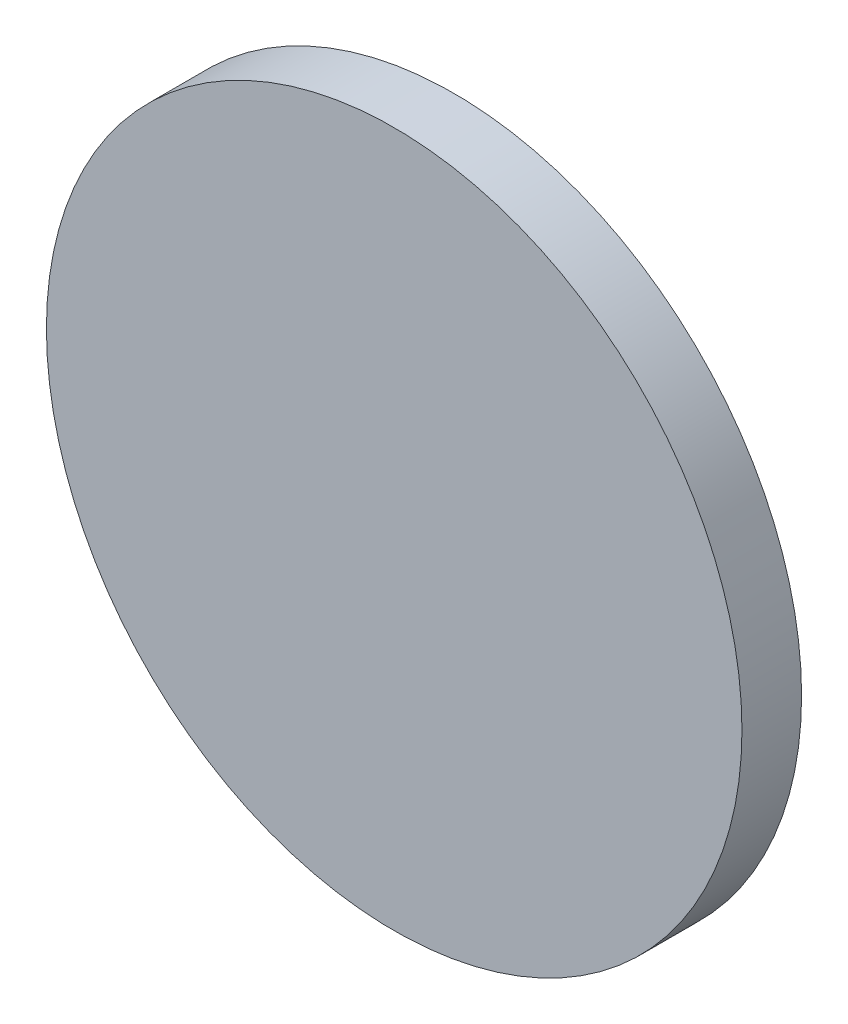
ISO-10303-21;
HEADER;
FILE_DESCRIPTION(('STEP AP214'),'2;1');
FILE_NAME('part.step','',(''),(''),'','','');
FILE_SCHEMA(('AUTOMOTIVE_DESIGN { 1 0 10303 214 1 1 1 1 }'));
ENDSEC;
DATA;
#1=APPLICATION_CONTEXT('core data for automotive mechanical design processes');
#2=APPLICATION_PROTOCOL_DEFINITION('international standard','automotive_design',2000,#1);
#3=PRODUCT_CONTEXT('',#1,'mechanical');
#4=PRODUCT('Part','Part','',(#3));
#5=PRODUCT_RELATED_PRODUCT_CATEGORY('part','',(#4));
#6=PRODUCT_DEFINITION_FORMATION('','',#4);
#7=PRODUCT_DEFINITION_CONTEXT('part definition',#1,'design');
#8=PRODUCT_DEFINITION('design','',#6,#7);
#9=PRODUCT_DEFINITION_SHAPE('','',#8);
#10=(LENGTH_UNIT() NAMED_UNIT(*) SI_UNIT(.MILLI.,.METRE.));
#11=(NAMED_UNIT(*) PLANE_ANGLE_UNIT() SI_UNIT($,.RADIAN.));
#12=(NAMED_UNIT(*) SI_UNIT($,.STERADIAN.) SOLID_ANGLE_UNIT());
#13=UNCERTAINTY_MEASURE_WITH_UNIT(LENGTH_MEASURE(1.E-05),#10,'distance_accuracy_value','');
#14=(GEOMETRIC_REPRESENTATION_CONTEXT(3) GLOBAL_UNCERTAINTY_ASSIGNED_CONTEXT((#13)) GLOBAL_UNIT_ASSIGNED_CONTEXT((#10,
#11,#12)) REPRESENTATION_CONTEXT('',''));
#15=CARTESIAN_POINT('',(0.,0.,0.));
#16=DIRECTION('',(0.,0.,1.));
#17=DIRECTION('',(1.,0.,0.));
#18=AXIS2_PLACEMENT_3D('',#15,#16,#17);
#19=CARTESIAN_POINT('',(7.00008,10.9,0.76487));
#20=DIRECTION('',(0.,0.,-1.));
#21=DIRECTION('',(-1.,0.,0.));
#22=AXIS2_PLACEMENT_3D('',#19,#20,#21);
#23=PLANE('',#22);
#24=CARTESIAN_POINT('',(7.00008,10.9,0.76487));
#25=DIRECTION('',(0.,0.,1.));
#26=DIRECTION('',(1.,0.,0.));
#27=AXIS2_PLACEMENT_3D('',#24,#25,#26);
#28=CIRCLE('',#27,0.200024667);
#29=CARTESIAN_POINT('',(7.200104667,10.9,0.76487));
#30=VERTEX_POINT('',#29);
#31=EDGE_CURVE('E18',#30,#30,#28,.T.);
#32=ORIENTED_EDGE('',*,*,#31,.F.);
#33=EDGE_LOOP('',(#32));
#34=FACE_BOUND('',#33,.T.);
#35=ADVANCED_FACE('F15',(#34),#23,.T.);
#36=CARTESIAN_POINT('',(7.00008,10.9,0.76487));
#37=DIRECTION('',(0.,0.,1.));
#38=DIRECTION('',(1.,0.,0.));
#39=AXIS2_PLACEMENT_3D('',#36,#37,#38);
#40=CYLINDRICAL_SURFACE('',#39,0.200024667);
#41=CARTESIAN_POINT('',(7.00008,10.9,0.79916));
#42=DIRECTION('',(0.,0.,1.));
#43=DIRECTION('',(1.,0.,0.));
#44=AXIS2_PLACEMENT_3D('',#41,#42,#43);
#45=CIRCLE('',#44,0.200024667);
#46=CARTESIAN_POINT('',(7.200104667,10.9,0.79916));
#47=VERTEX_POINT('',#46);
#48=EDGE_CURVE('E10',#47,#47,#45,.T.);
#49=ORIENTED_EDGE('',*,*,#48,.F.);
#50=EDGE_LOOP('',(#49));
#51=FACE_BOUND('',#50,.T.);
#52=ORIENTED_EDGE('',*,*,#31,.T.);
#53=EDGE_LOOP('',(#52));
#54=FACE_BOUND('',#53,.T.);
#55=ADVANCED_FACE('F27',(#51,#54),#40,.T.);
#56=CARTESIAN_POINT('',(7.00008,10.9,0.79916));
#57=DIRECTION('',(0.,0.,1.));
#58=DIRECTION('',(1.,0.,0.));
#59=AXIS2_PLACEMENT_3D('',#56,#57,#58);
#60=PLANE('',#59);
#61=ORIENTED_EDGE('',*,*,#48,.T.);
#62=EDGE_LOOP('',(#61));
#63=FACE_BOUND('',#62,.T.);
#64=ADVANCED_FACE('F34',(#63),#60,.T.);
#65=CLOSED_SHELL('',(#35,#55,#64));
#66=MANIFOLD_SOLID_BREP('B1',#65);
#67=ADVANCED_BREP_SHAPE_REPRESENTATION('',(#18,#66),#14);
#68=SHAPE_DEFINITION_REPRESENTATION(#9,#67);
ENDSEC;
END-ISO-10303-21;
